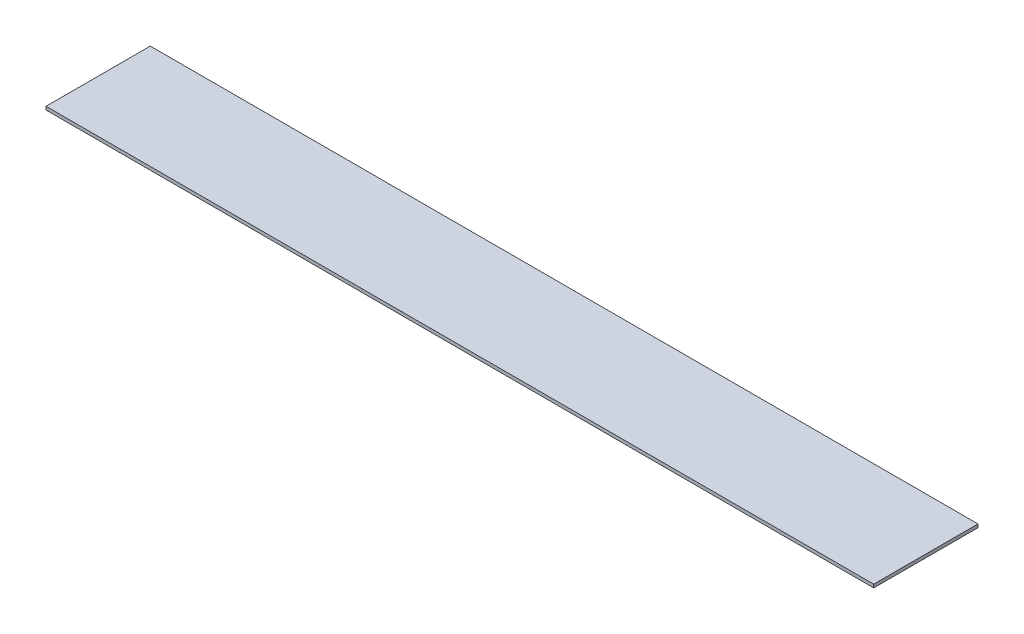
ISO-10303-21;
HEADER;
FILE_DESCRIPTION(('STEP AP214'),'2;1');
FILE_NAME('part.step','',(''),(''),'','','');
FILE_SCHEMA(('AUTOMOTIVE_DESIGN { 1 0 10303 214 1 1 1 1 }'));
ENDSEC;
DATA;
#1=APPLICATION_CONTEXT('core data for automotive mechanical design processes');
#2=APPLICATION_PROTOCOL_DEFINITION('international standard','automotive_design',2000,#1);
#3=PRODUCT_CONTEXT('',#1,'mechanical');
#4=PRODUCT('Part','Part','',(#3));
#5=PRODUCT_RELATED_PRODUCT_CATEGORY('part','',(#4));
#6=PRODUCT_DEFINITION_FORMATION('','',#4);
#7=PRODUCT_DEFINITION_CONTEXT('part definition',#1,'design');
#8=PRODUCT_DEFINITION('design','',#6,#7);
#9=PRODUCT_DEFINITION_SHAPE('','',#8);
#10=(LENGTH_UNIT() NAMED_UNIT(*) SI_UNIT(.MILLI.,.METRE.));
#11=(NAMED_UNIT(*) PLANE_ANGLE_UNIT() SI_UNIT($,.RADIAN.));
#12=(NAMED_UNIT(*) SI_UNIT($,.STERADIAN.) SOLID_ANGLE_UNIT());
#13=UNCERTAINTY_MEASURE_WITH_UNIT(LENGTH_MEASURE(1.E-05),#10,'distance_accuracy_value','');
#14=(GEOMETRIC_REPRESENTATION_CONTEXT(3) GLOBAL_UNCERTAINTY_ASSIGNED_CONTEXT((#13)) GLOBAL_UNIT_ASSIGNED_CONTEXT((#10,
#11,#12)) REPRESENTATION_CONTEXT('',''));
#15=CARTESIAN_POINT('',(0.,0.,0.));
#16=DIRECTION('',(0.,0.,1.));
#17=DIRECTION('',(1.,0.,0.));
#18=AXIS2_PLACEMENT_3D('',#15,#16,#17);
#19=CARTESIAN_POINT('',(63.5,0.5,8.));
#20=DIRECTION('',(-1.,0.,0.));
#21=DIRECTION('',(0.,0.,1.));
#22=AXIS2_PLACEMENT_3D('',#19,#20,#21);
#23=PLANE('',#22);
#24=DIRECTION('',(0.,0.,-1.));
#25=VECTOR('',#24,1.);
#26=CARTESIAN_POINT('',(63.5,0.,8.));
#27=LINE('',#26,#25);
#28=CARTESIAN_POINT('',(63.5,0.,8.));
#29=VERTEX_POINT('',#28);
#30=CARTESIAN_POINT('',(63.5,0.,-8.));
#31=VERTEX_POINT('',#30);
#32=EDGE_CURVE('E96',#29,#31,#27,.T.);
#33=ORIENTED_EDGE('',*,*,#32,.T.);
#34=DIRECTION('',(0.,-1.,0.));
#35=VECTOR('',#34,1.);
#36=CARTESIAN_POINT('',(63.5,0.5,-8.));
#37=LINE('',#36,#35);
#38=CARTESIAN_POINT('',(63.5,0.5,-8.));
#39=VERTEX_POINT('',#38);
#40=EDGE_CURVE('E11',#39,#31,#37,.T.);
#41=ORIENTED_EDGE('',*,*,#40,.F.);
#42=DIRECTION('',(0.,0.,-1.));
#43=VECTOR('',#42,1.);
#44=CARTESIAN_POINT('',(63.5,0.5,8.));
#45=LINE('',#44,#43);
#46=CARTESIAN_POINT('',(63.5,0.5,8.));
#47=VERTEX_POINT('',#46);
#48=EDGE_CURVE('E84',#47,#39,#45,.T.);
#49=ORIENTED_EDGE('',*,*,#48,.F.);
#50=DIRECTION('',(0.,-1.,0.));
#51=VECTOR('',#50,1.);
#52=CARTESIAN_POINT('',(63.5,0.5,8.));
#53=LINE('',#52,#51);
#54=EDGE_CURVE('E92',#47,#29,#53,.T.);
#55=ORIENTED_EDGE('',*,*,#54,.T.);
#56=EDGE_LOOP('',(#33,#41,#49,#55));
#57=FACE_BOUND('',#56,.T.);
#58=ADVANCED_FACE('F33',(#57),#23,.F.);
#59=CARTESIAN_POINT('',(-63.5,0.5,-8.));
#60=DIRECTION('',(0.,0.,1.));
#61=DIRECTION('',(1.,0.,0.));
#62=AXIS2_PLACEMENT_3D('',#59,#60,#61);
#63=PLANE('',#62);
#64=DIRECTION('',(-1.,0.,0.));
#65=VECTOR('',#64,1.);
#66=CARTESIAN_POINT('',(-63.5,0.,-8.));
#67=LINE('',#66,#65);
#68=CARTESIAN_POINT('',(-63.5,0.,-8.));
#69=VERTEX_POINT('',#68);
#70=EDGE_CURVE('E88',#31,#69,#67,.T.);
#71=ORIENTED_EDGE('',*,*,#70,.T.);
#72=DIRECTION('',(0.,-1.,0.));
#73=VECTOR('',#72,1.);
#74=CARTESIAN_POINT('',(-63.5,0.5,-8.));
#75=LINE('',#74,#73);
#76=CARTESIAN_POINT('',(-63.5,0.5,-8.));
#77=VERTEX_POINT('',#76);
#78=EDGE_CURVE('E41',#77,#69,#75,.T.);
#79=ORIENTED_EDGE('',*,*,#78,.F.);
#80=DIRECTION('',(-1.,0.,0.));
#81=VECTOR('',#80,1.);
#82=CARTESIAN_POINT('',(-63.5,0.5,-8.));
#83=LINE('',#82,#81);
#84=EDGE_CURVE('E79',#39,#77,#83,.T.);
#85=ORIENTED_EDGE('',*,*,#84,.F.);
#86=ORIENTED_EDGE('',*,*,#40,.T.);
#87=EDGE_LOOP('',(#71,#79,#85,#86));
#88=FACE_BOUND('',#87,.T.);
#89=ADVANCED_FACE('F87',(#88),#63,.F.);
#90=CARTESIAN_POINT('',(-63.5,0.5,8.));
#91=DIRECTION('',(1.,0.,0.));
#92=DIRECTION('',(0.,0.,-1.));
#93=AXIS2_PLACEMENT_3D('',#90,#91,#92);
#94=PLANE('',#93);
#95=DIRECTION('',(0.,0.,1.));
#96=VECTOR('',#95,1.);
#97=CARTESIAN_POINT('',(-63.5,0.,8.));
#98=LINE('',#97,#96);
#99=CARTESIAN_POINT('',(-63.5,0.,8.));
#100=VERTEX_POINT('',#99);
#101=EDGE_CURVE('E66',#69,#100,#98,.T.);
#102=ORIENTED_EDGE('',*,*,#101,.T.);
#103=DIRECTION('',(0.,-1.,0.));
#104=VECTOR('',#103,1.);
#105=CARTESIAN_POINT('',(-63.5,0.5,8.));
#106=LINE('',#105,#104);
#107=CARTESIAN_POINT('',(-63.5,0.5,8.));
#108=VERTEX_POINT('',#107);
#109=EDGE_CURVE('E89',#108,#100,#106,.T.);
#110=ORIENTED_EDGE('',*,*,#109,.F.);
#111=DIRECTION('',(0.,0.,1.));
#112=VECTOR('',#111,1.);
#113=CARTESIAN_POINT('',(-63.5,0.5,8.));
#114=LINE('',#113,#112);
#115=EDGE_CURVE('E82',#77,#108,#114,.T.);
#116=ORIENTED_EDGE('',*,*,#115,.F.);
#117=ORIENTED_EDGE('',*,*,#78,.T.);
#118=EDGE_LOOP('',(#102,#110,#116,#117));
#119=FACE_BOUND('',#118,.T.);
#120=ADVANCED_FACE('F90',(#119),#94,.F.);
#121=CARTESIAN_POINT('',(-63.5,0.5,8.));
#122=DIRECTION('',(0.,0.,-1.));
#123=DIRECTION('',(-1.,0.,0.));
#124=AXIS2_PLACEMENT_3D('',#121,#122,#123);
#125=PLANE('',#124);
#126=DIRECTION('',(1.,0.,0.));
#127=VECTOR('',#126,1.);
#128=CARTESIAN_POINT('',(-63.5,0.,8.));
#129=LINE('',#128,#127);
#130=EDGE_CURVE('E72',#100,#29,#129,.T.);
#131=ORIENTED_EDGE('',*,*,#130,.T.);
#132=ORIENTED_EDGE('',*,*,#54,.F.);
#133=DIRECTION('',(1.,0.,0.));
#134=VECTOR('',#133,1.);
#135=CARTESIAN_POINT('',(-63.5,0.5,8.));
#136=LINE('',#135,#134);
#137=EDGE_CURVE('E49',#108,#47,#136,.T.);
#138=ORIENTED_EDGE('',*,*,#137,.F.);
#139=ORIENTED_EDGE('',*,*,#109,.T.);
#140=EDGE_LOOP('',(#131,#132,#138,#139));
#141=FACE_BOUND('',#140,.T.);
#142=ADVANCED_FACE('F103',(#141),#125,.F.);
#143=CARTESIAN_POINT('',(0.,0.5,0.));
#144=DIRECTION('',(0.,-1.,0.));
#145=DIRECTION('',(0.,0.,-1.));
#146=AXIS2_PLACEMENT_3D('',#143,#144,#145);
#147=PLANE('',#146);
#148=ORIENTED_EDGE('',*,*,#48,.T.);
#149=ORIENTED_EDGE('',*,*,#84,.T.);
#150=ORIENTED_EDGE('',*,*,#115,.T.);
#151=ORIENTED_EDGE('',*,*,#137,.T.);
#152=EDGE_LOOP('',(#148,#149,#150,#151));
#153=FACE_BOUND('',#152,.T.);
#154=ADVANCED_FACE('F80',(#153),#147,.F.);
#155=CARTESIAN_POINT('',(0.,0.,0.));
#156=DIRECTION('',(0.,-1.,0.));
#157=DIRECTION('',(0.,0.,-1.));
#158=AXIS2_PLACEMENT_3D('',#155,#156,#157);
#159=PLANE('',#158);
#160=ORIENTED_EDGE('',*,*,#32,.F.);
#161=ORIENTED_EDGE('',*,*,#130,.F.);
#162=ORIENTED_EDGE('',*,*,#101,.F.);
#163=ORIENTED_EDGE('',*,*,#70,.F.);
#164=EDGE_LOOP('',(#160,#161,#162,#163));
#165=FACE_BOUND('',#164,.T.);
#166=ADVANCED_FACE('F106',(#165),#159,.T.);
#167=CLOSED_SHELL('',(#58,#89,#120,#142,#154,#166));
#168=MANIFOLD_SOLID_BREP('B2',#167);
#169=ADVANCED_BREP_SHAPE_REPRESENTATION('',(#18,#168),#14);
#170=SHAPE_DEFINITION_REPRESENTATION(#9,#169);
ENDSEC;
END-ISO-10303-21;
